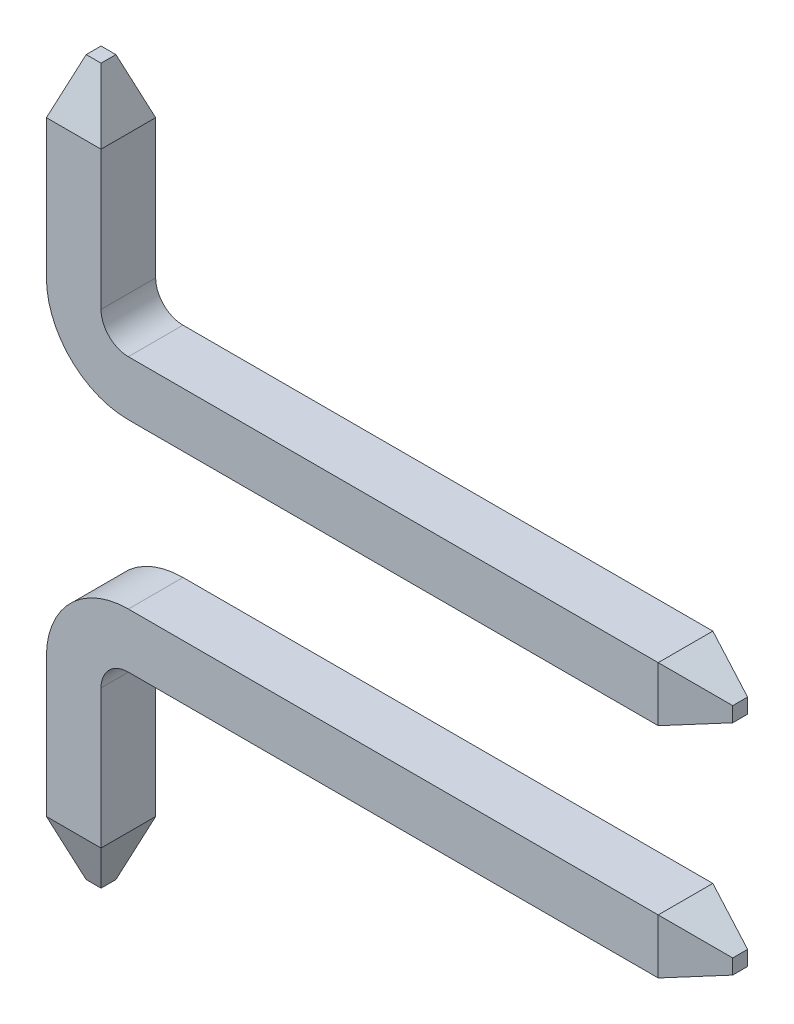
ISO-10303-21;
HEADER;
FILE_DESCRIPTION(('STEP AP214'),'2;1');
FILE_NAME('part.step','',(''),(''),'','','');
FILE_SCHEMA(('AUTOMOTIVE_DESIGN { 1 0 10303 214 1 1 1 1 }'));
ENDSEC;
DATA;
#1=APPLICATION_CONTEXT('core data for automotive mechanical design processes');
#2=APPLICATION_PROTOCOL_DEFINITION('international standard','automotive_design',2000,#1);
#3=PRODUCT_CONTEXT('',#1,'mechanical');
#4=PRODUCT('Part','Part','',(#3));
#5=PRODUCT_RELATED_PRODUCT_CATEGORY('part','',(#4));
#6=PRODUCT_DEFINITION_FORMATION('','',#4);
#7=PRODUCT_DEFINITION_CONTEXT('part definition',#1,'design');
#8=PRODUCT_DEFINITION('design','',#6,#7);
#9=PRODUCT_DEFINITION_SHAPE('','',#8);
#10=(LENGTH_UNIT() NAMED_UNIT(*) SI_UNIT(.MILLI.,.METRE.));
#11=(NAMED_UNIT(*) PLANE_ANGLE_UNIT() SI_UNIT($,.RADIAN.));
#12=(NAMED_UNIT(*) SI_UNIT($,.STERADIAN.) SOLID_ANGLE_UNIT());
#13=UNCERTAINTY_MEASURE_WITH_UNIT(LENGTH_MEASURE(1.E-05),#10,'distance_accuracy_value','');
#14=(GEOMETRIC_REPRESENTATION_CONTEXT(3) GLOBAL_UNCERTAINTY_ASSIGNED_CONTEXT((#13)) GLOBAL_UNIT_ASSIGNED_CONTEXT((#10,
#11,#12)) REPRESENTATION_CONTEXT('',''));
#15=CARTESIAN_POINT('',(0.,0.,0.));
#16=DIRECTION('',(0.,0.,1.));
#17=DIRECTION('',(1.,0.,0.));
#18=AXIS2_PLACEMENT_3D('',#15,#16,#17);
#19=CARTESIAN_POINT('',(0.75,4.02,0.));
#20=DIRECTION('',(0.,1.,0.));
#21=DIRECTION('',(0.,0.,-1.));
#22=AXIS2_PLACEMENT_3D('',#19,#20,#21);
#23=PLANE('',#22);
#24=DIRECTION('',(0.,0.,-1.));
#25=VECTOR('',#24,1.);
#26=CARTESIAN_POINT('',(0.75,4.02,0.));
#27=LINE('',#26,#25);
#28=CARTESIAN_POINT('',(0.75,4.02,0.));
#29=VERTEX_POINT('',#28);
#30=CARTESIAN_POINT('',(0.75,4.02,-0.5));
#31=VERTEX_POINT('',#30);
#32=EDGE_CURVE('E191',#29,#31,#27,.T.);
#33=ORIENTED_EDGE('',*,*,#32,.F.);
#34=DIRECTION('',(1.,0.,0.));
#35=VECTOR('',#34,1.);
#36=CARTESIAN_POINT('',(0.75,4.02,0.));
#37=LINE('',#36,#35);
#38=CARTESIAN_POINT('',(5.6,4.02,0.));
#39=VERTEX_POINT('',#38);
#40=EDGE_CURVE('E51',#29,#39,#37,.T.);
#41=ORIENTED_EDGE('',*,*,#40,.T.);
#42=DIRECTION('',(0.,0.,-1.));
#43=VECTOR('',#42,1.);
#44=CARTESIAN_POINT('',(5.6,4.02,0.));
#45=LINE('',#44,#43);
#46=CARTESIAN_POINT('',(5.6,4.02,-0.5));
#47=VERTEX_POINT('',#46);
#48=EDGE_CURVE('E207',#39,#47,#45,.T.);
#49=ORIENTED_EDGE('',*,*,#48,.T.);
#50=DIRECTION('',(1.,0.,0.));
#51=VECTOR('',#50,1.);
#52=CARTESIAN_POINT('',(0.75,4.02,-0.5));
#53=LINE('',#52,#51);
#54=EDGE_CURVE('E215',#31,#47,#53,.T.);
#55=ORIENTED_EDGE('',*,*,#54,.F.);
#56=EDGE_LOOP('',(#33,#41,#49,#55));
#57=FACE_BOUND('',#56,.T.);
#58=ADVANCED_FACE('F44',(#57),#23,.T.);
#59=CARTESIAN_POINT('',(0.75,3.52,0.));
#60=DIRECTION('',(0.,-1.,0.));
#61=DIRECTION('',(0.,0.,1.));
#62=AXIS2_PLACEMENT_3D('',#59,#60,#61);
#63=PLANE('',#62);
#64=DIRECTION('',(0.,0.,1.));
#65=VECTOR('',#64,1.);
#66=CARTESIAN_POINT('',(0.75,3.52,0.));
#67=LINE('',#66,#65);
#68=CARTESIAN_POINT('',(0.75,3.52,-0.5));
#69=VERTEX_POINT('',#68);
#70=CARTESIAN_POINT('',(0.75,3.52,0.));
#71=VERTEX_POINT('',#70);
#72=EDGE_CURVE('E188',#69,#71,#67,.T.);
#73=ORIENTED_EDGE('',*,*,#72,.F.);
#74=DIRECTION('',(1.,0.,0.));
#75=VECTOR('',#74,1.);
#76=CARTESIAN_POINT('',(0.75,3.52,-0.5));
#77=LINE('',#76,#75);
#78=CARTESIAN_POINT('',(5.6,3.52,-0.5));
#79=VERTEX_POINT('',#78);
#80=EDGE_CURVE('E212',#69,#79,#77,.T.);
#81=ORIENTED_EDGE('',*,*,#80,.T.);
#82=DIRECTION('',(0.,0.,1.));
#83=VECTOR('',#82,1.);
#84=CARTESIAN_POINT('',(5.6,3.52,0.));
#85=LINE('',#84,#83);
#86=CARTESIAN_POINT('',(5.6,3.52,0.));
#87=VERTEX_POINT('',#86);
#88=EDGE_CURVE('E201',#79,#87,#85,.T.);
#89=ORIENTED_EDGE('',*,*,#88,.T.);
#90=DIRECTION('',(1.,0.,0.));
#91=VECTOR('',#90,1.);
#92=CARTESIAN_POINT('',(0.75,3.52,0.));
#93=LINE('',#92,#91);
#94=EDGE_CURVE('E12',#71,#87,#93,.T.);
#95=ORIENTED_EDGE('',*,*,#94,.F.);
#96=EDGE_LOOP('',(#73,#81,#89,#95));
#97=FACE_BOUND('',#96,.T.);
#98=ADVANCED_FACE('F285',(#97),#63,.T.);
#99=CARTESIAN_POINT('',(0.75,4.27,0.));
#100=DIRECTION('',(0.,0.,-1.));
#101=DIRECTION('',(-1.,0.,0.));
#102=AXIS2_PLACEMENT_3D('',#99,#100,#101);
#103=CYLINDRICAL_SURFACE('',#102,0.25);
#104=DIRECTION('',(0.,0.,-1.));
#105=VECTOR('',#104,1.);
#106=CARTESIAN_POINT('',(0.5,4.27,0.));
#107=LINE('',#106,#105);
#108=CARTESIAN_POINT('',(0.5,4.27,0.));
#109=VERTEX_POINT('',#108);
#110=CARTESIAN_POINT('',(0.5,4.27,-0.5));
#111=VERTEX_POINT('',#110);
#112=EDGE_CURVE('E167',#109,#111,#107,.T.);
#113=ORIENTED_EDGE('',*,*,#112,.F.);
#114=CARTESIAN_POINT('',(0.75,4.27,0.));
#115=DIRECTION('',(0.,0.,1.));
#116=DIRECTION('',(-1.,0.,0.));
#117=AXIS2_PLACEMENT_3D('',#114,#115,#116);
#118=CIRCLE('',#117,0.25);
#119=EDGE_CURVE('E197',#109,#29,#118,.T.);
#120=ORIENTED_EDGE('',*,*,#119,.T.);
#121=ORIENTED_EDGE('',*,*,#32,.T.);
#122=CARTESIAN_POINT('',(0.75,4.27,-0.5));
#123=DIRECTION('',(0.,0.,1.));
#124=DIRECTION('',(-1.,0.,0.));
#125=AXIS2_PLACEMENT_3D('',#122,#123,#124);
#126=CIRCLE('',#125,0.25);
#127=EDGE_CURVE('E195',#111,#31,#126,.T.);
#128=ORIENTED_EDGE('',*,*,#127,.F.);
#129=EDGE_LOOP('',(#113,#120,#121,#128));
#130=FACE_BOUND('',#129,.T.);
#131=ADVANCED_FACE('F243',(#130),#103,.F.);
#132=CARTESIAN_POINT('',(0.75,4.27,0.));
#133=DIRECTION('',(0.,0.,-1.));
#134=DIRECTION('',(-1.,0.,0.));
#135=AXIS2_PLACEMENT_3D('',#132,#133,#134);
#136=CYLINDRICAL_SURFACE('',#135,0.75);
#137=DIRECTION('',(0.,0.,1.));
#138=VECTOR('',#137,1.);
#139=CARTESIAN_POINT('',(0.,4.27,0.));
#140=LINE('',#139,#138);
#141=CARTESIAN_POINT('',(0.,4.27,-0.5));
#142=VERTEX_POINT('',#141);
#143=CARTESIAN_POINT('',(0.,4.27,0.));
#144=VERTEX_POINT('',#143);
#145=EDGE_CURVE('E155',#142,#144,#140,.T.);
#146=ORIENTED_EDGE('',*,*,#145,.F.);
#147=CARTESIAN_POINT('',(0.75,4.27,-0.5));
#148=DIRECTION('',(0.,0.,1.));
#149=DIRECTION('',(-1.,0.,0.));
#150=AXIS2_PLACEMENT_3D('',#147,#148,#149);
#151=CIRCLE('',#150,0.75);
#152=EDGE_CURVE('E162',#142,#69,#151,.T.);
#153=ORIENTED_EDGE('',*,*,#152,.T.);
#154=ORIENTED_EDGE('',*,*,#72,.T.);
#155=CARTESIAN_POINT('',(0.75,4.27,0.));
#156=DIRECTION('',(0.,0.,1.));
#157=DIRECTION('',(-1.,0.,0.));
#158=AXIS2_PLACEMENT_3D('',#155,#156,#157);
#159=CIRCLE('',#158,0.75);
#160=EDGE_CURVE('E199',#144,#71,#159,.T.);
#161=ORIENTED_EDGE('',*,*,#160,.F.);
#162=EDGE_LOOP('',(#146,#153,#154,#161));
#163=FACE_BOUND('',#162,.T.);
#164=ADVANCED_FACE('F293',(#163),#136,.T.);
#165=CARTESIAN_POINT('',(0.,4.27,0.));
#166=DIRECTION('',(1.,0.,0.));
#167=DIRECTION('',(0.,0.,-1.));
#168=AXIS2_PLACEMENT_3D('',#165,#166,#167);
#169=PLANE('',#168);
#170=DIRECTION('',(0.,0.,1.));
#171=VECTOR('',#170,1.);
#172=CARTESIAN_POINT('',(0.,5.54,0.));
#173=LINE('',#172,#171);
#174=CARTESIAN_POINT('',(0.,5.54,-0.5));
#175=VERTEX_POINT('',#174);
#176=CARTESIAN_POINT('',(0.,5.54,0.));
#177=VERTEX_POINT('',#176);
#178=EDGE_CURVE('E140',#175,#177,#173,.T.);
#179=ORIENTED_EDGE('',*,*,#178,.F.);
#180=DIRECTION('',(0.,1.,0.));
#181=VECTOR('',#180,1.);
#182=CARTESIAN_POINT('',(0.,4.27,-0.5));
#183=LINE('',#182,#181);
#184=EDGE_CURVE('E159',#142,#175,#183,.T.);
#185=ORIENTED_EDGE('',*,*,#184,.F.);
#186=ORIENTED_EDGE('',*,*,#145,.T.);
#187=DIRECTION('',(0.,1.,0.));
#188=VECTOR('',#187,1.);
#189=CARTESIAN_POINT('',(0.,4.27,0.));
#190=LINE('',#189,#188);
#191=EDGE_CURVE('E171',#144,#177,#190,.T.);
#192=ORIENTED_EDGE('',*,*,#191,.T.);
#193=EDGE_LOOP('',(#179,#185,#186,#192));
#194=FACE_BOUND('',#193,.T.);
#195=ADVANCED_FACE('F170',(#194),#169,.F.);
#196=CARTESIAN_POINT('',(0.,4.27,0.));
#197=DIRECTION('',(0.,0.,-1.));
#198=DIRECTION('',(-1.,0.,0.));
#199=AXIS2_PLACEMENT_3D('',#196,#197,#198);
#200=PLANE('',#199);
#201=DIRECTION('',(1.,0.,0.));
#202=VECTOR('',#201,1.);
#203=CARTESIAN_POINT('',(0.,5.54,0.));
#204=LINE('',#203,#202);
#205=CARTESIAN_POINT('',(0.5,5.54,0.));
#206=VERTEX_POINT('',#205);
#207=EDGE_CURVE('E172',#177,#206,#204,.T.);
#208=ORIENTED_EDGE('',*,*,#207,.F.);
#209=ORIENTED_EDGE('',*,*,#191,.F.);
#210=ORIENTED_EDGE('',*,*,#160,.T.);
#211=ORIENTED_EDGE('',*,*,#94,.T.);
#212=DIRECTION('',(0.,1.,0.));
#213=VECTOR('',#212,1.);
#214=CARTESIAN_POINT('',(5.6,3.52,0.));
#215=LINE('',#214,#213);
#216=EDGE_CURVE('E210',#87,#39,#215,.T.);
#217=ORIENTED_EDGE('',*,*,#216,.T.);
#218=ORIENTED_EDGE('',*,*,#40,.F.);
#219=ORIENTED_EDGE('',*,*,#119,.F.);
#220=DIRECTION('',(0.,1.,0.));
#221=VECTOR('',#220,1.);
#222=CARTESIAN_POINT('',(0.5,4.27,0.));
#223=LINE('',#222,#221);
#224=EDGE_CURVE('E184',#109,#206,#223,.T.);
#225=ORIENTED_EDGE('',*,*,#224,.T.);
#226=EDGE_LOOP('',(#208,#209,#210,#211,#217,#218,#219,#225));
#227=FACE_BOUND('',#226,.T.);
#228=ADVANCED_FACE('F226',(#227),#200,.F.);
#229=CARTESIAN_POINT('',(0.5,4.27,0.));
#230=DIRECTION('',(-1.,0.,0.));
#231=DIRECTION('',(0.,0.,1.));
#232=AXIS2_PLACEMENT_3D('',#229,#230,#231);
#233=PLANE('',#232);
#234=DIRECTION('',(0.,0.,-1.));
#235=VECTOR('',#234,1.);
#236=CARTESIAN_POINT('',(0.5,5.54,0.));
#237=LINE('',#236,#235);
#238=CARTESIAN_POINT('',(0.5,5.54,-0.5));
#239=VERTEX_POINT('',#238);
#240=EDGE_CURVE('E156',#206,#239,#237,.T.);
#241=ORIENTED_EDGE('',*,*,#240,.F.);
#242=ORIENTED_EDGE('',*,*,#224,.F.);
#243=ORIENTED_EDGE('',*,*,#112,.T.);
#244=DIRECTION('',(0.,1.,0.));
#245=VECTOR('',#244,1.);
#246=CARTESIAN_POINT('',(0.5,4.27,-0.5));
#247=LINE('',#246,#245);
#248=EDGE_CURVE('E166',#111,#239,#247,.T.);
#249=ORIENTED_EDGE('',*,*,#248,.T.);
#250=EDGE_LOOP('',(#241,#242,#243,#249));
#251=FACE_BOUND('',#250,.T.);
#252=ADVANCED_FACE('F272',(#251),#233,.F.);
#253=CARTESIAN_POINT('',(0.,4.27,-0.5));
#254=DIRECTION('',(0.,0.,1.));
#255=DIRECTION('',(1.,0.,0.));
#256=AXIS2_PLACEMENT_3D('',#253,#254,#255);
#257=PLANE('',#256);
#258=DIRECTION('',(-1.,0.,0.));
#259=VECTOR('',#258,1.);
#260=CARTESIAN_POINT('',(0.,5.54,-0.5));
#261=LINE('',#260,#259);
#262=EDGE_CURVE('E149',#239,#175,#261,.T.);
#263=ORIENTED_EDGE('',*,*,#262,.F.);
#264=ORIENTED_EDGE('',*,*,#248,.F.);
#265=ORIENTED_EDGE('',*,*,#127,.T.);
#266=ORIENTED_EDGE('',*,*,#54,.T.);
#267=DIRECTION('',(0.,-1.,0.));
#268=VECTOR('',#267,1.);
#269=CARTESIAN_POINT('',(5.6,3.52,-0.5));
#270=LINE('',#269,#268);
#271=EDGE_CURVE('E204',#47,#79,#270,.T.);
#272=ORIENTED_EDGE('',*,*,#271,.T.);
#273=ORIENTED_EDGE('',*,*,#80,.F.);
#274=ORIENTED_EDGE('',*,*,#152,.F.);
#275=ORIENTED_EDGE('',*,*,#184,.T.);
#276=EDGE_LOOP('',(#263,#264,#265,#266,#272,#273,#274,#275));
#277=FACE_BOUND('',#276,.T.);
#278=ADVANCED_FACE('F160',(#277),#257,.F.);
#279=CARTESIAN_POINT('',(5.6,3.52,0.));
#280=DIRECTION('',(0.342020143325669,0.,0.939692620785908));
#281=DIRECTION('',(0.939692620785909,0.,-0.342020143325669));
#282=AXIS2_PLACEMENT_3D('',#279,#280,#281);
#283=PLANE('',#282);
#284=ORIENTED_EDGE('',*,*,#216,.F.);
#285=DIRECTION('',(-0.889126490715988,-0.323615577118184,0.323615577118185));
#286=VECTOR('',#285,1.);
#287=CARTESIAN_POINT('',(5.6,3.52,0.));
#288=LINE('',#287,#286);
#289=CARTESIAN_POINT('',(6.1,3.7019851171331,-0.181985117133101));
#290=VERTEX_POINT('',#289);
#291=EDGE_CURVE('E58',#290,#87,#288,.T.);
#292=ORIENTED_EDGE('',*,*,#291,.F.);
#293=DIRECTION('',(0.,-1.,0.));
#294=VECTOR('',#293,1.);
#295=CARTESIAN_POINT('',(6.1,3.52,-0.181985117133101));
#296=LINE('',#295,#294);
#297=CARTESIAN_POINT('',(6.1,3.8380148828669,-0.181985117133101));
#298=VERTEX_POINT('',#297);
#299=EDGE_CURVE('E145',#290,#298,#296,.F.);
#300=ORIENTED_EDGE('',*,*,#299,.T.);
#301=DIRECTION('',(-0.889126490715988,0.323615577118185,0.323615577118185));
#302=VECTOR('',#301,1.);
#303=CARTESIAN_POINT('',(5.6,4.02,0.));
#304=LINE('',#303,#302);
#305=EDGE_CURVE('E65',#298,#39,#304,.T.);
#306=ORIENTED_EDGE('',*,*,#305,.T.);
#307=EDGE_LOOP('',(#284,#292,#300,#306));
#308=FACE_BOUND('',#307,.T.);
#309=ADVANCED_FACE('F308',(#308),#283,.T.);
#310=CARTESIAN_POINT('',(5.6,4.02,0.));
#311=DIRECTION('',(0.342020143325669,0.939692620785908,0.));
#312=DIRECTION('',(0.939692620785908,-0.342020143325669,0.));
#313=AXIS2_PLACEMENT_3D('',#310,#311,#312);
#314=PLANE('',#313);
#315=ORIENTED_EDGE('',*,*,#48,.F.);
#316=ORIENTED_EDGE('',*,*,#305,.F.);
#317=DIRECTION('',(0.,0.,1.));
#318=VECTOR('',#317,1.);
#319=CARTESIAN_POINT('',(6.1,3.8380148828669,0.));
#320=LINE('',#319,#318);
#321=CARTESIAN_POINT('',(6.1,3.8380148828669,-0.318014882866899));
#322=VERTEX_POINT('',#321);
#323=EDGE_CURVE('E234',#298,#322,#320,.F.);
#324=ORIENTED_EDGE('',*,*,#323,.T.);
#325=DIRECTION('',(-0.889126490715988,0.323615577118185,-0.323615577118185));
#326=VECTOR('',#325,1.);
#327=CARTESIAN_POINT('',(5.74386759121206,3.96763647912323,-0.447636479123232));
#328=LINE('',#327,#326);
#329=EDGE_CURVE('E176',#322,#47,#328,.T.);
#330=ORIENTED_EDGE('',*,*,#329,.T.);
#331=EDGE_LOOP('',(#315,#316,#324,#330));
#332=FACE_BOUND('',#331,.T.);
#333=ADVANCED_FACE('F230',(#332),#314,.T.);
#334=CARTESIAN_POINT('',(5.6,3.52,-0.5));
#335=DIRECTION('',(0.342020143325669,0.,-0.939692620785908));
#336=DIRECTION('',(-0.939692620785909,0.,-0.342020143325669));
#337=AXIS2_PLACEMENT_3D('',#334,#335,#336);
#338=PLANE('',#337);
#339=ORIENTED_EDGE('',*,*,#271,.F.);
#340=ORIENTED_EDGE('',*,*,#329,.F.);
#341=DIRECTION('',(0.,1.,0.));
#342=VECTOR('',#341,1.);
#343=CARTESIAN_POINT('',(6.1,3.52,-0.318014882866899));
#344=LINE('',#343,#342);
#345=CARTESIAN_POINT('',(6.1,3.7019851171331,-0.318014882866899));
#346=VERTEX_POINT('',#345);
#347=EDGE_CURVE('E249',#322,#346,#344,.F.);
#348=ORIENTED_EDGE('',*,*,#347,.T.);
#349=DIRECTION('',(-0.889126490715988,-0.323615577118184,-0.323615577118185));
#350=VECTOR('',#349,1.);
#351=CARTESIAN_POINT('',(5.74386759121206,3.57236352087677,-0.447636479123232));
#352=LINE('',#351,#350);
#353=EDGE_CURVE('E237',#346,#79,#352,.T.);
#354=ORIENTED_EDGE('',*,*,#353,.T.);
#355=EDGE_LOOP('',(#339,#340,#348,#354));
#356=FACE_BOUND('',#355,.T.);
#357=ADVANCED_FACE('F239',(#356),#338,.T.);
#358=CARTESIAN_POINT('',(5.6,3.52,0.));
#359=DIRECTION('',(0.342020143325668,-0.939692620785909,0.));
#360=DIRECTION('',(-0.939692620785909,-0.342020143325668,0.));
#361=AXIS2_PLACEMENT_3D('',#358,#359,#360);
#362=PLANE('',#361);
#363=ORIENTED_EDGE('',*,*,#88,.F.);
#364=ORIENTED_EDGE('',*,*,#353,.F.);
#365=DIRECTION('',(0.,0.,-1.));
#366=VECTOR('',#365,1.);
#367=CARTESIAN_POINT('',(6.1,3.7019851171331,0.));
#368=LINE('',#367,#366);
#369=EDGE_CURVE('E247',#346,#290,#368,.F.);
#370=ORIENTED_EDGE('',*,*,#369,.T.);
#371=ORIENTED_EDGE('',*,*,#291,.T.);
#372=EDGE_LOOP('',(#363,#364,#370,#371));
#373=FACE_BOUND('',#372,.T.);
#374=ADVANCED_FACE('F313',(#373),#362,.T.);
#375=CARTESIAN_POINT('',(6.1,4.02,0.));
#376=DIRECTION('',(1.,0.,0.));
#377=DIRECTION('',(0.,0.,-1.));
#378=AXIS2_PLACEMENT_3D('',#375,#376,#377);
#379=PLANE('',#378);
#380=ORIENTED_EDGE('',*,*,#299,.F.);
#381=ORIENTED_EDGE('',*,*,#369,.F.);
#382=ORIENTED_EDGE('',*,*,#347,.F.);
#383=ORIENTED_EDGE('',*,*,#323,.F.);
#384=EDGE_LOOP('',(#380,#381,#382,#383));
#385=FACE_BOUND('',#384,.T.);
#386=ADVANCED_FACE('F316',(#385),#379,.T.);
#387=CARTESIAN_POINT('',(0.,5.54,0.));
#388=DIRECTION('',(-0.939692620785908,0.342020143325669,0.));
#389=DIRECTION('',(0.342020143325669,0.939692620785909,0.));
#390=AXIS2_PLACEMENT_3D('',#387,#388,#389);
#391=PLANE('',#390);
#392=ORIENTED_EDGE('',*,*,#178,.T.);
#393=DIRECTION('',(-0.323615577118185,-0.889126490715988,0.323615577118185));
#394=VECTOR('',#393,1.);
#395=CARTESIAN_POINT('',(0.,5.54,0.));
#396=LINE('',#395,#394);
#397=CARTESIAN_POINT('',(0.181985117133101,6.04,-0.181985117133101));
#398=VERTEX_POINT('',#397);
#399=EDGE_CURVE('E257',#398,#177,#396,.T.);
#400=ORIENTED_EDGE('',*,*,#399,.F.);
#401=DIRECTION('',(0.,0.,1.));
#402=VECTOR('',#401,1.);
#403=CARTESIAN_POINT('',(0.181985117133101,6.04,0.));
#404=LINE('',#403,#402);
#405=CARTESIAN_POINT('',(0.181985117133101,6.04,-0.318014882866899));
#406=VERTEX_POINT('',#405);
#407=EDGE_CURVE('E142',#398,#406,#404,.F.);
#408=ORIENTED_EDGE('',*,*,#407,.T.);
#409=DIRECTION('',(-0.323615577118185,-0.889126490715988,-0.323615577118185));
#410=VECTOR('',#409,1.);
#411=CARTESIAN_POINT('',(0.,5.54,-0.5));
#412=LINE('',#411,#410);
#413=EDGE_CURVE('E135',#406,#175,#412,.T.);
#414=ORIENTED_EDGE('',*,*,#413,.T.);
#415=EDGE_LOOP('',(#392,#400,#408,#414));
#416=FACE_BOUND('',#415,.T.);
#417=ADVANCED_FACE('F137',(#416),#391,.T.);
#418=CARTESIAN_POINT('',(0.,5.54,-0.5));
#419=DIRECTION('',(0.,0.342020143325669,-0.939692620785908));
#420=DIRECTION('',(0.,-0.939692620785909,-0.342020143325669));
#421=AXIS2_PLACEMENT_3D('',#418,#419,#420);
#422=PLANE('',#421);
#423=ORIENTED_EDGE('',*,*,#262,.T.);
#424=ORIENTED_EDGE('',*,*,#413,.F.);
#425=DIRECTION('',(-1.,0.,0.));
#426=VECTOR('',#425,1.);
#427=CARTESIAN_POINT('',(0.,6.04,-0.318014882866899));
#428=LINE('',#427,#426);
#429=CARTESIAN_POINT('',(0.318014882866899,6.04,-0.318014882866899));
#430=VERTEX_POINT('',#429);
#431=EDGE_CURVE('E261',#406,#430,#428,.F.);
#432=ORIENTED_EDGE('',*,*,#431,.T.);
#433=DIRECTION('',(0.323615577118185,-0.889126490715988,-0.323615577118185));
#434=VECTOR('',#433,1.);
#435=CARTESIAN_POINT('',(0.447636479123232,5.68386759121206,-0.447636479123232));
#436=LINE('',#435,#434);
#437=EDGE_CURVE('E146',#430,#239,#436,.T.);
#438=ORIENTED_EDGE('',*,*,#437,.T.);
#439=EDGE_LOOP('',(#423,#424,#432,#438));
#440=FACE_BOUND('',#439,.T.);
#441=ADVANCED_FACE('F151',(#440),#422,.T.);
#442=CARTESIAN_POINT('',(0.5,5.54,0.));
#443=DIRECTION('',(0.939692620785908,0.342020143325669,0.));
#444=DIRECTION('',(0.342020143325669,-0.939692620785909,0.));
#445=AXIS2_PLACEMENT_3D('',#442,#443,#444);
#446=PLANE('',#445);
#447=ORIENTED_EDGE('',*,*,#240,.T.);
#448=ORIENTED_EDGE('',*,*,#437,.F.);
#449=DIRECTION('',(0.,0.,-1.));
#450=VECTOR('',#449,1.);
#451=CARTESIAN_POINT('',(0.318014882866899,6.04,0.));
#452=LINE('',#451,#450);
#453=CARTESIAN_POINT('',(0.318014882866899,6.04,-0.181985117133101));
#454=VERTEX_POINT('',#453);
#455=EDGE_CURVE('E258',#430,#454,#452,.F.);
#456=ORIENTED_EDGE('',*,*,#455,.T.);
#457=DIRECTION('',(0.323615577118185,-0.889126490715988,0.323615577118185));
#458=VECTOR('',#457,1.);
#459=CARTESIAN_POINT('',(0.447636479123232,5.68386759121206,-0.052363520876768));
#460=LINE('',#459,#458);
#461=EDGE_CURVE('E265',#454,#206,#460,.T.);
#462=ORIENTED_EDGE('',*,*,#461,.T.);
#463=EDGE_LOOP('',(#447,#448,#456,#462));
#464=FACE_BOUND('',#463,.T.);
#465=ADVANCED_FACE('F274',(#464),#446,.T.);
#466=CARTESIAN_POINT('',(0.,5.54,0.));
#467=DIRECTION('',(0.,0.342020143325669,0.939692620785908));
#468=DIRECTION('',(0.,0.939692620785909,-0.342020143325669));
#469=AXIS2_PLACEMENT_3D('',#466,#467,#468);
#470=PLANE('',#469);
#471=ORIENTED_EDGE('',*,*,#207,.T.);
#472=ORIENTED_EDGE('',*,*,#461,.F.);
#473=DIRECTION('',(1.,0.,0.));
#474=VECTOR('',#473,1.);
#475=CARTESIAN_POINT('',(0.,6.04,-0.181985117133101));
#476=LINE('',#475,#474);
#477=EDGE_CURVE('E255',#454,#398,#476,.F.);
#478=ORIENTED_EDGE('',*,*,#477,.T.);
#479=ORIENTED_EDGE('',*,*,#399,.T.);
#480=EDGE_LOOP('',(#471,#472,#478,#479));
#481=FACE_BOUND('',#480,.T.);
#482=ADVANCED_FACE('F268',(#481),#470,.T.);
#483=CARTESIAN_POINT('',(0.,6.04,-0.5));
#484=DIRECTION('',(0.,1.,0.));
#485=DIRECTION('',(0.,0.,-1.));
#486=AXIS2_PLACEMENT_3D('',#483,#484,#485);
#487=PLANE('',#486);
#488=ORIENTED_EDGE('',*,*,#407,.F.);
#489=ORIENTED_EDGE('',*,*,#477,.F.);
#490=ORIENTED_EDGE('',*,*,#455,.F.);
#491=ORIENTED_EDGE('',*,*,#431,.F.);
#492=EDGE_LOOP('',(#488,#489,#490,#491));
#493=FACE_BOUND('',#492,.T.);
#494=ADVANCED_FACE('F276',(#493),#487,.T.);
#495=CLOSED_SHELL('',(#58,#98,#131,#164,#195,#228,#252,#278,#309,#333,#357,#374,#386,#417,#441,
#465,#482,#494));
#496=MANIFOLD_SOLID_BREP('B2',#495);
#497=CARTESIAN_POINT('',(0.75,1.52,0.));
#498=DIRECTION('',(0.,-1.,0.));
#499=DIRECTION('',(0.,0.,-1.));
#500=AXIS2_PLACEMENT_3D('',#497,#498,#499);
#501=PLANE('',#500);
#502=DIRECTION('',(0.,0.,-1.));
#503=VECTOR('',#502,1.);
#504=CARTESIAN_POINT('',(0.75,1.52,0.));
#505=LINE('',#504,#503);
#506=CARTESIAN_POINT('',(0.75,1.52,0.));
#507=VERTEX_POINT('',#506);
#508=CARTESIAN_POINT('',(0.75,1.52,-0.5));
#509=VERTEX_POINT('',#508);
#510=EDGE_CURVE('E622',#507,#509,#505,.T.);
#511=ORIENTED_EDGE('',*,*,#510,.T.);
#512=DIRECTION('',(1.,0.,0.));
#513=VECTOR('',#512,1.);
#514=CARTESIAN_POINT('',(0.75,1.52,-0.5));
#515=LINE('',#514,#513);
#516=CARTESIAN_POINT('',(5.6,1.52,-0.5));
#517=VERTEX_POINT('',#516);
#518=EDGE_CURVE('E646',#509,#517,#515,.T.);
#519=ORIENTED_EDGE('',*,*,#518,.T.);
#520=DIRECTION('',(0.,0.,-1.));
#521=VECTOR('',#520,1.);
#522=CARTESIAN_POINT('',(5.6,1.52,0.));
#523=LINE('',#522,#521);
#524=CARTESIAN_POINT('',(5.6,1.52,0.));
#525=VERTEX_POINT('',#524);
#526=EDGE_CURVE('E500',#525,#517,#523,.T.);
#527=ORIENTED_EDGE('',*,*,#526,.F.);
#528=DIRECTION('',(1.,0.,0.));
#529=VECTOR('',#528,1.);
#530=CARTESIAN_POINT('',(0.75,1.52,0.));
#531=LINE('',#530,#529);
#532=EDGE_CURVE('E486',#507,#525,#531,.T.);
#533=ORIENTED_EDGE('',*,*,#532,.F.);
#534=EDGE_LOOP('',(#511,#519,#527,#533));
#535=FACE_BOUND('',#534,.T.);
#536=ADVANCED_FACE('F479',(#535),#501,.T.);
#537=CARTESIAN_POINT('',(0.75,2.02,0.));
#538=DIRECTION('',(0.,1.,0.));
#539=DIRECTION('',(0.,0.,1.));
#540=AXIS2_PLACEMENT_3D('',#537,#538,#539);
#541=PLANE('',#540);
#542=DIRECTION('',(0.,0.,1.));
#543=VECTOR('',#542,1.);
#544=CARTESIAN_POINT('',(0.75,2.02,0.));
#545=LINE('',#544,#543);
#546=CARTESIAN_POINT('',(0.75,2.02,-0.5));
#547=VERTEX_POINT('',#546);
#548=CARTESIAN_POINT('',(0.75,2.02,0.));
#549=VERTEX_POINT('',#548);
#550=EDGE_CURVE('E619',#547,#549,#545,.T.);
#551=ORIENTED_EDGE('',*,*,#550,.T.);
#552=DIRECTION('',(1.,0.,0.));
#553=VECTOR('',#552,1.);
#554=CARTESIAN_POINT('',(0.75,2.02,0.));
#555=LINE('',#554,#553);
#556=CARTESIAN_POINT('',(5.6,2.02,0.));
#557=VERTEX_POINT('',#556);
#558=EDGE_CURVE('E42',#549,#557,#555,.T.);
#559=ORIENTED_EDGE('',*,*,#558,.T.);
#560=DIRECTION('',(0.,0.,1.));
#561=VECTOR('',#560,1.);
#562=CARTESIAN_POINT('',(5.6,2.02,0.));
#563=LINE('',#562,#561);
#564=CARTESIAN_POINT('',(5.6,2.02,-0.5));
#565=VERTEX_POINT('',#564);
#566=EDGE_CURVE('E636',#565,#557,#563,.T.);
#567=ORIENTED_EDGE('',*,*,#566,.F.);
#568=DIRECTION('',(1.,0.,0.));
#569=VECTOR('',#568,1.);
#570=CARTESIAN_POINT('',(0.75,2.02,-0.5));
#571=LINE('',#570,#569);
#572=EDGE_CURVE('E644',#547,#565,#571,.T.);
#573=ORIENTED_EDGE('',*,*,#572,.F.);
#574=EDGE_LOOP('',(#551,#559,#567,#573));
#575=FACE_BOUND('',#574,.T.);
#576=ADVANCED_FACE('F715',(#575),#541,.T.);
#577=CARTESIAN_POINT('',(0.75,1.27,0.));
#578=DIRECTION('',(0.,0.,-1.));
#579=DIRECTION('',(-1.,0.,0.));
#580=AXIS2_PLACEMENT_3D('',#577,#578,#579);
#581=CYLINDRICAL_SURFACE('',#580,0.25);
#582=DIRECTION('',(0.,0.,-1.));
#583=VECTOR('',#582,1.);
#584=CARTESIAN_POINT('',(0.5,1.27,0.));
#585=LINE('',#584,#583);
#586=CARTESIAN_POINT('',(0.5,1.27,0.));
#587=VERTEX_POINT('',#586);
#588=CARTESIAN_POINT('',(0.5,1.27,-0.5));
#589=VERTEX_POINT('',#588);
#590=EDGE_CURVE('E607',#587,#589,#585,.T.);
#591=ORIENTED_EDGE('',*,*,#590,.T.);
#592=CARTESIAN_POINT('',(0.75,1.27,-0.5));
#593=DIRECTION('',(0.,0.,-1.));
#594=DIRECTION('',(-1.,0.,0.));
#595=AXIS2_PLACEMENT_3D('',#592,#593,#594);
#596=CIRCLE('',#595,0.25);
#597=EDGE_CURVE('E627',#589,#509,#596,.T.);
#598=ORIENTED_EDGE('',*,*,#597,.T.);
#599=ORIENTED_EDGE('',*,*,#510,.F.);
#600=CARTESIAN_POINT('',(0.75,1.27,0.));
#601=DIRECTION('',(0.,0.,-1.));
#602=DIRECTION('',(-1.,0.,0.));
#603=AXIS2_PLACEMENT_3D('',#600,#601,#602);
#604=CIRCLE('',#603,0.25);
#605=EDGE_CURVE('E630',#587,#507,#604,.T.);
#606=ORIENTED_EDGE('',*,*,#605,.F.);
#607=EDGE_LOOP('',(#591,#598,#599,#606));
#608=FACE_BOUND('',#607,.T.);
#609=ADVANCED_FACE('F719',(#608),#581,.F.);
#610=CARTESIAN_POINT('',(0.75,1.27,0.));
#611=DIRECTION('',(0.,0.,-1.));
#612=DIRECTION('',(-1.,0.,0.));
#613=AXIS2_PLACEMENT_3D('',#610,#611,#612);
#614=CYLINDRICAL_SURFACE('',#613,0.75);
#615=DIRECTION('',(0.,0.,1.));
#616=VECTOR('',#615,1.);
#617=CARTESIAN_POINT('',(0.,1.27,0.));
#618=LINE('',#617,#616);
#619=CARTESIAN_POINT('',(0.,1.27,-0.5));
#620=VERTEX_POINT('',#619);
#621=CARTESIAN_POINT('',(0.,1.27,0.));
#622=VERTEX_POINT('',#621);
#623=EDGE_CURVE('E602',#620,#622,#618,.T.);
#624=ORIENTED_EDGE('',*,*,#623,.T.);
#625=CARTESIAN_POINT('',(0.75,1.27,0.));
#626=DIRECTION('',(0.,0.,-1.));
#627=DIRECTION('',(-1.,0.,0.));
#628=AXIS2_PLACEMENT_3D('',#625,#626,#627);
#629=CIRCLE('',#628,0.75);
#630=EDGE_CURVE('E633',#622,#549,#629,.T.);
#631=ORIENTED_EDGE('',*,*,#630,.T.);
#632=ORIENTED_EDGE('',*,*,#550,.F.);
#633=CARTESIAN_POINT('',(0.75,1.27,-0.5));
#634=DIRECTION('',(0.,0.,-1.));
#635=DIRECTION('',(-1.,0.,0.));
#636=AXIS2_PLACEMENT_3D('',#633,#634,#635);
#637=CIRCLE('',#636,0.75);
#638=EDGE_CURVE('E625',#620,#547,#637,.T.);
#639=ORIENTED_EDGE('',*,*,#638,.F.);
#640=EDGE_LOOP('',(#624,#631,#632,#639));
#641=FACE_BOUND('',#640,.T.);
#642=ADVANCED_FACE('F754',(#641),#614,.T.);
#643=CARTESIAN_POINT('',(0.,1.27,0.));
#644=DIRECTION('',(1.,0.,0.));
#645=DIRECTION('',(0.,0.,-1.));
#646=AXIS2_PLACEMENT_3D('',#643,#644,#645);
#647=PLANE('',#646);
#648=DIRECTION('',(0.,0.,1.));
#649=VECTOR('',#648,1.);
#650=CARTESIAN_POINT('',(0.,0.,0.));
#651=LINE('',#650,#649);
#652=CARTESIAN_POINT('',(0.,0.,-0.5));
#653=VERTEX_POINT('',#652);
#654=CARTESIAN_POINT('',(0.,0.,0.));
#655=VERTEX_POINT('',#654);
#656=EDGE_CURVE('E582',#653,#655,#651,.T.);
#657=ORIENTED_EDGE('',*,*,#656,.T.);
#658=DIRECTION('',(0.,-1.,0.));
#659=VECTOR('',#658,1.);
#660=CARTESIAN_POINT('',(0.,1.27,0.));
#661=LINE('',#660,#659);
#662=EDGE_CURVE('E617',#622,#655,#661,.T.);
#663=ORIENTED_EDGE('',*,*,#662,.F.);
#664=ORIENTED_EDGE('',*,*,#623,.F.);
#665=DIRECTION('',(0.,-1.,0.));
#666=VECTOR('',#665,1.);
#667=CARTESIAN_POINT('',(0.,1.27,-0.5));
#668=LINE('',#667,#666);
#669=EDGE_CURVE('E598',#620,#653,#668,.T.);
#670=ORIENTED_EDGE('',*,*,#669,.T.);
#671=EDGE_LOOP('',(#657,#663,#664,#670));
#672=FACE_BOUND('',#671,.T.);
#673=ADVANCED_FACE('F605',(#672),#647,.F.);
#674=CARTESIAN_POINT('',(0.,1.27,0.));
#675=DIRECTION('',(0.,0.,-1.));
#676=DIRECTION('',(-1.,0.,0.));
#677=AXIS2_PLACEMENT_3D('',#674,#675,#676);
#678=PLANE('',#677);
#679=DIRECTION('',(1.,0.,0.));
#680=VECTOR('',#679,1.);
#681=CARTESIAN_POINT('',(0.,0.,0.));
#682=LINE('',#681,#680);
#683=CARTESIAN_POINT('',(0.5,0.,0.));
#684=VERTEX_POINT('',#683);
#685=EDGE_CURVE('E590',#655,#684,#682,.T.);
#686=ORIENTED_EDGE('',*,*,#685,.T.);
#687=DIRECTION('',(0.,-1.,0.));
#688=VECTOR('',#687,1.);
#689=CARTESIAN_POINT('',(0.5,1.27,0.));
#690=LINE('',#689,#688);
#691=EDGE_CURVE('E609',#587,#684,#690,.T.);
#692=ORIENTED_EDGE('',*,*,#691,.F.);
#693=ORIENTED_EDGE('',*,*,#605,.T.);
#694=ORIENTED_EDGE('',*,*,#532,.T.);
#695=DIRECTION('',(0.,-1.,0.));
#696=VECTOR('',#695,1.);
#697=CARTESIAN_POINT('',(5.6,2.02,0.));
#698=LINE('',#697,#696);
#699=EDGE_CURVE('E493',#557,#525,#698,.T.);
#700=ORIENTED_EDGE('',*,*,#699,.F.);
#701=ORIENTED_EDGE('',*,*,#558,.F.);
#702=ORIENTED_EDGE('',*,*,#630,.F.);
#703=ORIENTED_EDGE('',*,*,#662,.T.);
#704=EDGE_LOOP('',(#686,#692,#693,#694,#700,#701,#702,#703));
#705=FACE_BOUND('',#704,.T.);
#706=ADVANCED_FACE('F649',(#705),#678,.F.);
#707=CARTESIAN_POINT('',(0.5,1.27,0.));
#708=DIRECTION('',(-1.,0.,0.));
#709=DIRECTION('',(0.,0.,1.));
#710=AXIS2_PLACEMENT_3D('',#707,#708,#709);
#711=PLANE('',#710);
#712=DIRECTION('',(0.,0.,-1.));
#713=VECTOR('',#712,1.);
#714=CARTESIAN_POINT('',(0.5,0.,0.));
#715=LINE('',#714,#713);
#716=CARTESIAN_POINT('',(0.5,0.,-0.5));
#717=VERTEX_POINT('',#716);
#718=EDGE_CURVE('E603',#684,#717,#715,.T.);
#719=ORIENTED_EDGE('',*,*,#718,.T.);
#720=DIRECTION('',(0.,-1.,0.));
#721=VECTOR('',#720,1.);
#722=CARTESIAN_POINT('',(0.5,1.27,-0.5));
#723=LINE('',#722,#721);
#724=EDGE_CURVE('E601',#589,#717,#723,.T.);
#725=ORIENTED_EDGE('',*,*,#724,.F.);
#726=ORIENTED_EDGE('',*,*,#590,.F.);
#727=ORIENTED_EDGE('',*,*,#691,.T.);
#728=EDGE_LOOP('',(#719,#725,#726,#727));
#729=FACE_BOUND('',#728,.T.);
#730=ADVANCED_FACE('F686',(#729),#711,.F.);
#731=CARTESIAN_POINT('',(0.,1.27,-0.5));
#732=DIRECTION('',(0.,0.,1.));
#733=DIRECTION('',(1.,0.,0.));
#734=AXIS2_PLACEMENT_3D('',#731,#732,#733);
#735=PLANE('',#734);
#736=DIRECTION('',(-1.,0.,0.));
#737=VECTOR('',#736,1.);
#738=CARTESIAN_POINT('',(0.,0.,-0.5));
#739=LINE('',#738,#737);
#740=EDGE_CURVE('E571',#717,#653,#739,.T.);
#741=ORIENTED_EDGE('',*,*,#740,.T.);
#742=ORIENTED_EDGE('',*,*,#669,.F.);
#743=ORIENTED_EDGE('',*,*,#638,.T.);
#744=ORIENTED_EDGE('',*,*,#572,.T.);
#745=DIRECTION('',(0.,1.,0.));
#746=VECTOR('',#745,1.);
#747=CARTESIAN_POINT('',(5.6,2.02,-0.5));
#748=LINE('',#747,#746);
#749=EDGE_CURVE('E639',#517,#565,#748,.T.);
#750=ORIENTED_EDGE('',*,*,#749,.F.);
#751=ORIENTED_EDGE('',*,*,#518,.F.);
#752=ORIENTED_EDGE('',*,*,#597,.F.);
#753=ORIENTED_EDGE('',*,*,#724,.T.);
#754=EDGE_LOOP('',(#741,#742,#743,#744,#750,#751,#752,#753));
#755=FACE_BOUND('',#754,.T.);
#756=ADVANCED_FACE('F596',(#755),#735,.F.);
#757=CARTESIAN_POINT('',(5.6,2.02,0.));
#758=DIRECTION('',(0.342020143325669,0.,0.939692620785908));
#759=DIRECTION('',(0.939692620785909,0.,-0.342020143325669));
#760=AXIS2_PLACEMENT_3D('',#757,#758,#759);
#761=PLANE('',#760);
#762=ORIENTED_EDGE('',*,*,#699,.T.);
#763=DIRECTION('',(-0.889126490715988,-0.323615577118185,0.323615577118185));
#764=VECTOR('',#763,1.);
#765=CARTESIAN_POINT('',(5.6,1.52,0.));
#766=LINE('',#765,#764);
#767=CARTESIAN_POINT('',(6.1,1.7019851171331,-0.181985117133101));
#768=VERTEX_POINT('',#767);
#769=EDGE_CURVE('E591',#768,#525,#766,.T.);
#770=ORIENTED_EDGE('',*,*,#769,.F.);
#771=DIRECTION('',(0.,1.,0.));
#772=VECTOR('',#771,1.);
#773=CARTESIAN_POINT('',(6.1,2.02,-0.181985117133101));
#774=LINE('',#773,#772);
#775=CARTESIAN_POINT('',(6.1,1.8380148828669,-0.181985117133101));
#776=VERTEX_POINT('',#775);
#777=EDGE_CURVE('E577',#776,#768,#774,.F.);
#778=ORIENTED_EDGE('',*,*,#777,.F.);
#779=DIRECTION('',(-0.889126490715988,0.323615577118184,0.323615577118185));
#780=VECTOR('',#779,1.);
#781=CARTESIAN_POINT('',(5.6,2.02,0.));
#782=LINE('',#781,#780);
#783=EDGE_CURVE('E666',#776,#557,#782,.T.);
#784=ORIENTED_EDGE('',*,*,#783,.T.);
#785=EDGE_LOOP('',(#762,#770,#778,#784));
#786=FACE_BOUND('',#785,.T.);
#787=ADVANCED_FACE('F664',(#786),#761,.T.);
#788=CARTESIAN_POINT('',(5.6,1.52,0.));
#789=DIRECTION('',(0.342020143325669,-0.939692620785908,0.));
#790=DIRECTION('',(0.939692620785908,0.342020143325669,0.));
#791=AXIS2_PLACEMENT_3D('',#788,#789,#790);
#792=PLANE('',#791);
#793=ORIENTED_EDGE('',*,*,#526,.T.);
#794=DIRECTION('',(-0.889126490715988,-0.323615577118185,-0.323615577118185));
#795=VECTOR('',#794,1.);
#796=CARTESIAN_POINT('',(5.74386759121206,1.57236352087677,-0.447636479123232));
#797=LINE('',#796,#795);
#798=CARTESIAN_POINT('',(6.1,1.7019851171331,-0.318014882866899));
#799=VERTEX_POINT('',#798);
#800=EDGE_CURVE('E661',#799,#517,#797,.T.);
#801=ORIENTED_EDGE('',*,*,#800,.F.);
#802=DIRECTION('',(0.,0.,1.));
#803=VECTOR('',#802,1.);
#804=CARTESIAN_POINT('',(6.1,1.7019851171331,0.));
#805=LINE('',#804,#803);
#806=EDGE_CURVE('E657',#768,#799,#805,.F.);
#807=ORIENTED_EDGE('',*,*,#806,.F.);
#808=ORIENTED_EDGE('',*,*,#769,.T.);
#809=EDGE_LOOP('',(#793,#801,#807,#808));
#810=FACE_BOUND('',#809,.T.);
#811=ADVANCED_FACE('F654',(#810),#792,.T.);
#812=CARTESIAN_POINT('',(5.6,2.02,-0.5));
#813=DIRECTION('',(0.342020143325669,0.,-0.939692620785908));
#814=DIRECTION('',(-0.939692620785909,0.,-0.342020143325669));
#815=AXIS2_PLACEMENT_3D('',#812,#813,#814);
#816=PLANE('',#815);
#817=ORIENTED_EDGE('',*,*,#749,.T.);
#818=DIRECTION('',(-0.889126490715988,0.323615577118184,-0.323615577118185));
#819=VECTOR('',#818,1.);
#820=CARTESIAN_POINT('',(5.74386759121206,1.96763647912323,-0.447636479123232));
#821=LINE('',#820,#819);
#822=CARTESIAN_POINT('',(6.1,1.8380148828669,-0.318014882866899));
#823=VERTEX_POINT('',#822);
#824=EDGE_CURVE('E669',#823,#565,#821,.T.);
#825=ORIENTED_EDGE('',*,*,#824,.F.);
#826=DIRECTION('',(0.,-1.,0.));
#827=VECTOR('',#826,1.);
#828=CARTESIAN_POINT('',(6.1,2.02,-0.318014882866899));
#829=LINE('',#828,#827);
#830=EDGE_CURVE('E674',#799,#823,#829,.F.);
#831=ORIENTED_EDGE('',*,*,#830,.F.);
#832=ORIENTED_EDGE('',*,*,#800,.T.);
#833=EDGE_LOOP('',(#817,#825,#831,#832));
#834=FACE_BOUND('',#833,.T.);
#835=ADVANCED_FACE('F725',(#834),#816,.T.);
#836=CARTESIAN_POINT('',(5.6,2.02,0.));
#837=DIRECTION('',(0.342020143325668,0.939692620785909,0.));
#838=DIRECTION('',(-0.939692620785909,0.342020143325668,0.));
#839=AXIS2_PLACEMENT_3D('',#836,#837,#838);
#840=PLANE('',#839);
#841=ORIENTED_EDGE('',*,*,#566,.T.);
#842=ORIENTED_EDGE('',*,*,#783,.F.);
#843=DIRECTION('',(0.,0.,-1.));
#844=VECTOR('',#843,1.);
#845=CARTESIAN_POINT('',(6.1,1.8380148828669,0.));
#846=LINE('',#845,#844);
#847=EDGE_CURVE('E670',#823,#776,#846,.F.);
#848=ORIENTED_EDGE('',*,*,#847,.F.);
#849=ORIENTED_EDGE('',*,*,#824,.T.);
#850=EDGE_LOOP('',(#841,#842,#848,#849));
#851=FACE_BOUND('',#850,.T.);
#852=ADVANCED_FACE('F727',(#851),#840,.T.);
#853=CARTESIAN_POINT('',(6.1,1.52,0.));
#854=DIRECTION('',(1.,0.,0.));
#855=DIRECTION('',(0.,0.,-1.));
#856=AXIS2_PLACEMENT_3D('',#853,#854,#855);
#857=PLANE('',#856);
#858=ORIENTED_EDGE('',*,*,#777,.T.);
#859=ORIENTED_EDGE('',*,*,#806,.T.);
#860=ORIENTED_EDGE('',*,*,#830,.T.);
#861=ORIENTED_EDGE('',*,*,#847,.T.);
#862=EDGE_LOOP('',(#858,#859,#860,#861));
#863=FACE_BOUND('',#862,.T.);
#864=ADVANCED_FACE('F729',(#863),#857,.T.);
#865=CARTESIAN_POINT('',(0.,0.,0.));
#866=DIRECTION('',(-0.939692620785908,-0.342020143325669,0.));
#867=DIRECTION('',(0.342020143325669,-0.939692620785909,0.));
#868=AXIS2_PLACEMENT_3D('',#865,#866,#867);
#869=PLANE('',#868);
#870=ORIENTED_EDGE('',*,*,#656,.F.);
#871=DIRECTION('',(-0.323615577118185,0.889126490715988,-0.323615577118185));
#872=VECTOR('',#871,1.);
#873=CARTESIAN_POINT('',(0.,0.,-0.5));
#874=LINE('',#873,#872);
#875=CARTESIAN_POINT('',(0.181985117133101,-0.5,-0.318014882866899));
#876=VERTEX_POINT('',#875);
#877=EDGE_CURVE('E566',#876,#653,#874,.T.);
#878=ORIENTED_EDGE('',*,*,#877,.F.);
#879=DIRECTION('',(0.,0.,1.));
#880=VECTOR('',#879,1.);
#881=CARTESIAN_POINT('',(0.181985117133101,-0.5,0.));
#882=LINE('',#881,#880);
#883=CARTESIAN_POINT('',(0.181985117133101,-0.5,-0.181985117133101));
#884=VERTEX_POINT('',#883);
#885=EDGE_CURVE('E701',#884,#876,#882,.F.);
#886=ORIENTED_EDGE('',*,*,#885,.F.);
#887=DIRECTION('',(-0.323615577118185,0.889126490715988,0.323615577118185));
#888=VECTOR('',#887,1.);
#889=CARTESIAN_POINT('',(0.,0.,0.));
#890=LINE('',#889,#888);
#891=EDGE_CURVE('E585',#884,#655,#890,.T.);
#892=ORIENTED_EDGE('',*,*,#891,.T.);
#893=EDGE_LOOP('',(#870,#878,#886,#892));
#894=FACE_BOUND('',#893,.T.);
#895=ADVANCED_FACE('F583',(#894),#869,.T.);
#896=CARTESIAN_POINT('',(0.,0.,-0.5));
#897=DIRECTION('',(0.,-0.342020143325669,-0.939692620785908));
#898=DIRECTION('',(0.,0.939692620785909,-0.342020143325669));
#899=AXIS2_PLACEMENT_3D('',#896,#897,#898);
#900=PLANE('',#899);
#901=ORIENTED_EDGE('',*,*,#740,.F.);
#902=DIRECTION('',(0.323615577118185,0.889126490715988,-0.323615577118185));
#903=VECTOR('',#902,1.);
#904=CARTESIAN_POINT('',(0.447636479123232,-0.143867591212061,-0.447636479123232));
#905=LINE('',#904,#903);
#906=CARTESIAN_POINT('',(0.318014882866899,-0.5,-0.318014882866899));
#907=VERTEX_POINT('',#906);
#908=EDGE_CURVE('E578',#907,#717,#905,.T.);
#909=ORIENTED_EDGE('',*,*,#908,.F.);
#910=DIRECTION('',(-1.,0.,0.));
#911=VECTOR('',#910,1.);
#912=CARTESIAN_POINT('',(0.,-0.5,-0.318014882866899));
#913=LINE('',#912,#911);
#914=EDGE_CURVE('E573',#876,#907,#913,.F.);
#915=ORIENTED_EDGE('',*,*,#914,.F.);
#916=ORIENTED_EDGE('',*,*,#877,.T.);
#917=EDGE_LOOP('',(#901,#909,#915,#916));
#918=FACE_BOUND('',#917,.T.);
#919=ADVANCED_FACE('F568',(#918),#900,.T.);
#920=CARTESIAN_POINT('',(0.5,0.,0.));
#921=DIRECTION('',(0.939692620785908,-0.342020143325669,0.));
#922=DIRECTION('',(0.342020143325669,0.939692620785909,0.));
#923=AXIS2_PLACEMENT_3D('',#920,#921,#922);
#924=PLANE('',#923);
#925=ORIENTED_EDGE('',*,*,#718,.F.);
#926=DIRECTION('',(0.323615577118185,0.889126490715988,0.323615577118185));
#927=VECTOR('',#926,1.);
#928=CARTESIAN_POINT('',(0.447636479123232,-0.143867591212061,-0.052363520876768));
#929=LINE('',#928,#927);
#930=CARTESIAN_POINT('',(0.318014882866899,-0.5,-0.181985117133101));
#931=VERTEX_POINT('',#930);
#932=EDGE_CURVE('E692',#931,#684,#929,.T.);
#933=ORIENTED_EDGE('',*,*,#932,.F.);
#934=DIRECTION('',(0.,0.,-1.));
#935=VECTOR('',#934,1.);
#936=CARTESIAN_POINT('',(0.318014882866899,-0.5,0.));
#937=LINE('',#936,#935);
#938=EDGE_CURVE('E704',#907,#931,#937,.F.);
#939=ORIENTED_EDGE('',*,*,#938,.F.);
#940=ORIENTED_EDGE('',*,*,#908,.T.);
#941=EDGE_LOOP('',(#925,#933,#939,#940));
#942=FACE_BOUND('',#941,.T.);
#943=ADVANCED_FACE('F690',(#942),#924,.T.);
#944=CARTESIAN_POINT('',(0.,0.,0.));
#945=DIRECTION('',(0.,-0.342020143325669,0.939692620785908));
#946=DIRECTION('',(0.,-0.939692620785909,-0.342020143325669));
#947=AXIS2_PLACEMENT_3D('',#944,#945,#946);
#948=PLANE('',#947);
#949=ORIENTED_EDGE('',*,*,#685,.F.);
#950=ORIENTED_EDGE('',*,*,#891,.F.);
#951=DIRECTION('',(1.,0.,0.));
#952=VECTOR('',#951,1.);
#953=CARTESIAN_POINT('',(0.,-0.5,-0.181985117133101));
#954=LINE('',#953,#952);
#955=EDGE_CURVE('E696',#931,#884,#954,.F.);
#956=ORIENTED_EDGE('',*,*,#955,.F.);
#957=ORIENTED_EDGE('',*,*,#932,.T.);
#958=EDGE_LOOP('',(#949,#950,#956,#957));
#959=FACE_BOUND('',#958,.T.);
#960=ADVANCED_FACE('F695',(#959),#948,.T.);
#961=CARTESIAN_POINT('',(0.,-0.5,-0.5));
#962=DIRECTION('',(0.,-1.,0.));
#963=DIRECTION('',(0.,0.,-1.));
#964=AXIS2_PLACEMENT_3D('',#961,#962,#963);
#965=PLANE('',#964);
#966=ORIENTED_EDGE('',*,*,#885,.T.);
#967=ORIENTED_EDGE('',*,*,#914,.T.);
#968=ORIENTED_EDGE('',*,*,#938,.T.);
#969=ORIENTED_EDGE('',*,*,#955,.T.);
#970=EDGE_LOOP('',(#966,#967,#968,#969));
#971=FACE_BOUND('',#970,.T.);
#972=ADVANCED_FACE('F706',(#971),#965,.T.);
#973=CLOSED_SHELL('',(#536,#576,#609,#642,#673,#706,#730,#756,#787,#811,#835,#852,#864,#895,
#919,#943,#960,#972));
#974=MANIFOLD_SOLID_BREP('B6',#973);
#975=ADVANCED_BREP_SHAPE_REPRESENTATION('',(#18,#496,#974),#14);
#976=SHAPE_DEFINITION_REPRESENTATION(#9,#975);
ENDSEC;
END-ISO-10303-21;
